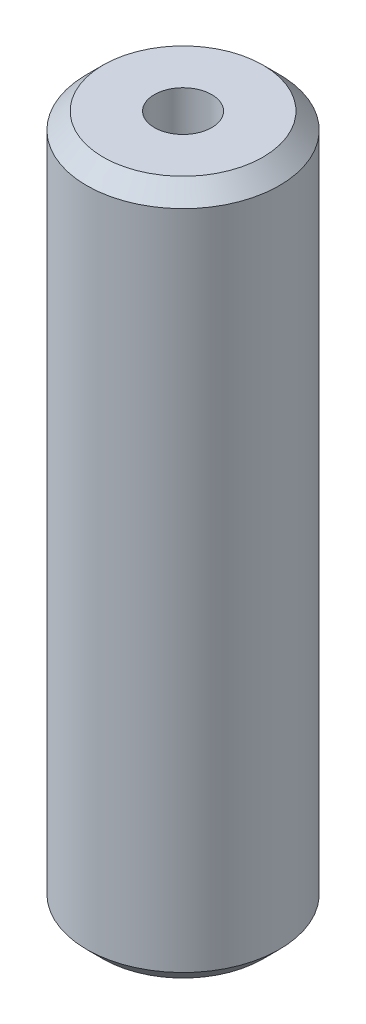
ISO-10303-21;
HEADER;
FILE_DESCRIPTION(('STEP AP214'),'2;1');
FILE_NAME('part.step','',(''),(''),'','','');
FILE_SCHEMA(('AUTOMOTIVE_DESIGN { 1 0 10303 214 1 1 1 1 }'));
ENDSEC;
DATA;
#1=APPLICATION_CONTEXT('core data for automotive mechanical design processes');
#2=APPLICATION_PROTOCOL_DEFINITION('international standard','automotive_design',2000,#1);
#3=PRODUCT_CONTEXT('',#1,'mechanical');
#4=PRODUCT('Part','Part','',(#3));
#5=PRODUCT_RELATED_PRODUCT_CATEGORY('part','',(#4));
#6=PRODUCT_DEFINITION_FORMATION('','',#4);
#7=PRODUCT_DEFINITION_CONTEXT('part definition',#1,'design');
#8=PRODUCT_DEFINITION('design','',#6,#7);
#9=PRODUCT_DEFINITION_SHAPE('','',#8);
#10=(LENGTH_UNIT() NAMED_UNIT(*) SI_UNIT(.MILLI.,.METRE.));
#11=(NAMED_UNIT(*) PLANE_ANGLE_UNIT() SI_UNIT($,.RADIAN.));
#12=(NAMED_UNIT(*) SI_UNIT($,.STERADIAN.) SOLID_ANGLE_UNIT());
#13=UNCERTAINTY_MEASURE_WITH_UNIT(LENGTH_MEASURE(1.E-05),#10,'distance_accuracy_value','');
#14=(GEOMETRIC_REPRESENTATION_CONTEXT(3) GLOBAL_UNCERTAINTY_ASSIGNED_CONTEXT((#13)) GLOBAL_UNIT_ASSIGNED_CONTEXT((#10,
#11,#12)) REPRESENTATION_CONTEXT('',''));
#15=CARTESIAN_POINT('',(0.,0.,0.));
#16=DIRECTION('',(0.,0.,1.));
#17=DIRECTION('',(1.,0.,0.));
#18=AXIS2_PLACEMENT_3D('',#15,#16,#17);
#19=CARTESIAN_POINT('',(0.,126.194895960188,0.));
#20=DIRECTION('',(0.,-1.,0.));
#21=DIRECTION('',(0.,0.,-1.));
#22=AXIS2_PLACEMENT_3D('',#19,#20,#21);
#23=CYLINDRICAL_SURFACE('',#22,17.5);
#24=CARTESIAN_POINT('',(0.,123.208789206303,0.));
#25=DIRECTION('',(0.,1.,0.));
#26=DIRECTION('',(0.,0.,1.));
#27=AXIS2_PLACEMENT_3D('',#24,#25,#26);
#28=CIRCLE('',#27,17.5);
#29=CARTESIAN_POINT('',(0.,123.208789206303,17.5));
#30=VERTEX_POINT('',#29);
#31=EDGE_CURVE('E50',#30,#30,#28,.F.);
#32=ORIENTED_EDGE('',*,*,#31,.T.);
#33=EDGE_LOOP('',(#32));
#34=FACE_BOUND('',#33,.T.);
#35=CARTESIAN_POINT('',(0.,2.98610675388469,0.));
#36=DIRECTION('',(0.,1.,0.));
#37=DIRECTION('',(0.,0.,1.));
#38=AXIS2_PLACEMENT_3D('',#35,#36,#37);
#39=CIRCLE('',#38,17.5);
#40=CARTESIAN_POINT('',(0.,2.98610675388469,17.5));
#41=VERTEX_POINT('',#40);
#42=EDGE_CURVE('E51',#41,#41,#39,.T.);
#43=ORIENTED_EDGE('',*,*,#42,.T.);
#44=EDGE_LOOP('',(#43));
#45=FACE_BOUND('',#44,.T.);
#46=ADVANCED_FACE('F39',(#34,#45),#23,.T.);
#47=CARTESIAN_POINT('',(0.,126.194895960188,0.));
#48=DIRECTION('',(0.,1.,0.));
#49=DIRECTION('',(0.,0.,1.));
#50=AXIS2_PLACEMENT_3D('',#47,#48,#49);
#51=PLANE('',#50);
#52=CARTESIAN_POINT('',(0.,126.194895960188,0.));
#53=DIRECTION('',(0.,1.,0.));
#54=DIRECTION('',(0.,0.,1.));
#55=AXIS2_PLACEMENT_3D('',#52,#53,#54);
#56=CIRCLE('',#55,14.5138932461153);
#57=CARTESIAN_POINT('',(0.,126.194895960188,14.5138932461153));
#58=VERTEX_POINT('',#57);
#59=EDGE_CURVE('E54',#58,#58,#56,.T.);
#60=ORIENTED_EDGE('',*,*,#59,.T.);
#61=EDGE_LOOP('',(#60));
#62=FACE_BOUND('',#61,.T.);
#63=CARTESIAN_POINT('',(0.,126.194895960188,0.));
#64=DIRECTION('',(0.,1.,0.));
#65=DIRECTION('',(0.,0.,1.));
#66=AXIS2_PLACEMENT_3D('',#63,#64,#65);
#67=CIRCLE('',#66,5.20902346105371);
#68=CARTESIAN_POINT('',(0.,126.194895960188,5.20902346105371));
#69=VERTEX_POINT('',#68);
#70=EDGE_CURVE('E58',#69,#69,#67,.T.);
#71=ORIENTED_EDGE('',*,*,#70,.F.);
#72=EDGE_LOOP('',(#71));
#73=FACE_BOUND('',#72,.T.);
#74=ADVANCED_FACE('F69',(#62,#73),#51,.T.);
#75=CARTESIAN_POINT('',(0.,0.,0.));
#76=DIRECTION('',(0.,1.,0.));
#77=DIRECTION('',(0.,0.,1.));
#78=AXIS2_PLACEMENT_3D('',#75,#76,#77);
#79=PLANE('',#78);
#80=CARTESIAN_POINT('',(0.,0.,0.));
#81=DIRECTION('',(0.,1.,0.));
#82=DIRECTION('',(0.,0.,1.));
#83=AXIS2_PLACEMENT_3D('',#80,#81,#82);
#84=CIRCLE('',#83,14.5138932461153);
#85=CARTESIAN_POINT('',(0.,0.,14.5138932461153));
#86=VERTEX_POINT('',#85);
#87=EDGE_CURVE('E10',#86,#86,#84,.F.);
#88=ORIENTED_EDGE('',*,*,#87,.T.);
#89=EDGE_LOOP('',(#88));
#90=FACE_BOUND('',#89,.T.);
#91=CARTESIAN_POINT('',(0.,0.,0.));
#92=DIRECTION('',(0.,1.,0.));
#93=DIRECTION('',(0.,0.,1.));
#94=AXIS2_PLACEMENT_3D('',#91,#92,#93);
#95=CIRCLE('',#94,5.20902346105371);
#96=CARTESIAN_POINT('',(0.,0.,5.20902346105371));
#97=VERTEX_POINT('',#96);
#98=EDGE_CURVE('E63',#97,#97,#95,.T.);
#99=ORIENTED_EDGE('',*,*,#98,.T.);
#100=EDGE_LOOP('',(#99));
#101=FACE_BOUND('',#100,.T.);
#102=ADVANCED_FACE('F75',(#90,#101),#79,.F.);
#103=CARTESIAN_POINT('',(0.,126.194895960188,0.));
#104=DIRECTION('',(0.,-1.,0.));
#105=DIRECTION('',(0.,0.,-1.));
#106=AXIS2_PLACEMENT_3D('',#103,#104,#105);
#107=CYLINDRICAL_SURFACE('',#106,5.20902346105371);
#108=ORIENTED_EDGE('',*,*,#70,.T.);
#109=EDGE_LOOP('',(#108));
#110=FACE_BOUND('',#109,.T.);
#111=ORIENTED_EDGE('',*,*,#98,.F.);
#112=EDGE_LOOP('',(#111));
#113=FACE_BOUND('',#112,.T.);
#114=ADVANCED_FACE('F70',(#110,#113),#107,.F.);
#115=CARTESIAN_POINT('',(0.,126.194895960188,0.));
#116=DIRECTION('',(0.,-1.,0.));
#117=DIRECTION('',(0.,0.,-1.));
#118=AXIS2_PLACEMENT_3D('',#115,#116,#117);
#119=CONICAL_SURFACE('',#118,14.5138932461153,0.785398163397442);
#120=ORIENTED_EDGE('',*,*,#31,.F.);
#121=EDGE_LOOP('',(#120));
#122=FACE_BOUND('',#121,.T.);
#123=ORIENTED_EDGE('',*,*,#59,.F.);
#124=EDGE_LOOP('',(#123));
#125=FACE_BOUND('',#124,.T.);
#126=ADVANCED_FACE('F81',(#122,#125),#119,.T.);
#127=CARTESIAN_POINT('',(0.,2.98610675388469,0.));
#128=DIRECTION('',(0.,1.,0.));
#129=DIRECTION('',(0.,0.,1.));
#130=AXIS2_PLACEMENT_3D('',#127,#128,#129);
#131=CONICAL_SURFACE('',#130,17.5,0.785398163397451);
#132=ORIENTED_EDGE('',*,*,#87,.F.);
#133=EDGE_LOOP('',(#132));
#134=FACE_BOUND('',#133,.T.);
#135=ORIENTED_EDGE('',*,*,#42,.F.);
#136=EDGE_LOOP('',(#135));
#137=FACE_BOUND('',#136,.T.);
#138=ADVANCED_FACE('F45',(#134,#137),#131,.T.);
#139=CLOSED_SHELL('',(#46,#74,#102,#114,#126,#138));
#140=MANIFOLD_SOLID_BREP('B2',#139);
#141=ADVANCED_BREP_SHAPE_REPRESENTATION('',(#18,#140),#14);
#142=SHAPE_DEFINITION_REPRESENTATION(#9,#141);
ENDSEC;
END-ISO-10303-21;
